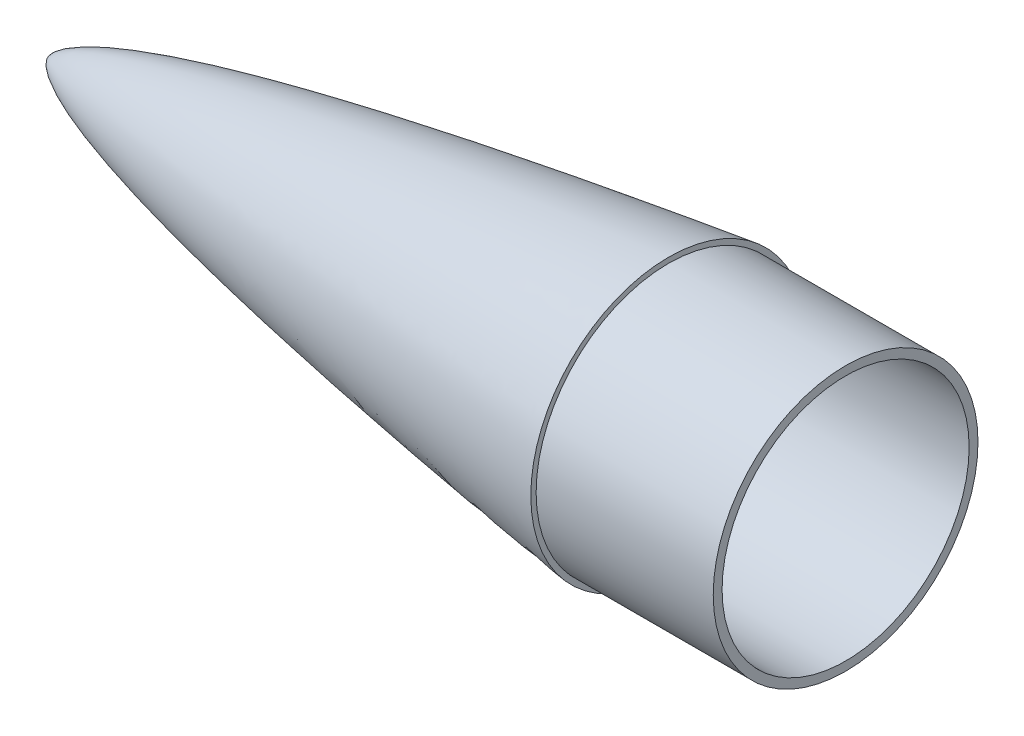
ISO-10303-21;
HEADER;
FILE_DESCRIPTION(('STEP AP214'),'2;1');
FILE_NAME('part.step','',(''),(''),'','','');
FILE_SCHEMA(('AUTOMOTIVE_DESIGN { 1 0 10303 214 1 1 1 1 }'));
ENDSEC;
DATA;
#1=APPLICATION_CONTEXT('core data for automotive mechanical design processes');
#2=APPLICATION_PROTOCOL_DEFINITION('international standard','automotive_design',2000,#1);
#3=PRODUCT_CONTEXT('',#1,'mechanical');
#4=PRODUCT('Part','Part','',(#3));
#5=PRODUCT_RELATED_PRODUCT_CATEGORY('part','',(#4));
#6=PRODUCT_DEFINITION_FORMATION('','',#4);
#7=PRODUCT_DEFINITION_CONTEXT('part definition',#1,'design');
#8=PRODUCT_DEFINITION('design','',#6,#7);
#9=PRODUCT_DEFINITION_SHAPE('','',#8);
#10=(LENGTH_UNIT() NAMED_UNIT(*) SI_UNIT(.MILLI.,.METRE.));
#11=(NAMED_UNIT(*) PLANE_ANGLE_UNIT() SI_UNIT($,.RADIAN.));
#12=(NAMED_UNIT(*) SI_UNIT($,.STERADIAN.) SOLID_ANGLE_UNIT());
#13=UNCERTAINTY_MEASURE_WITH_UNIT(LENGTH_MEASURE(1.E-05),#10,'distance_accuracy_value','');
#14=(GEOMETRIC_REPRESENTATION_CONTEXT(3) GLOBAL_UNCERTAINTY_ASSIGNED_CONTEXT((#13)) GLOBAL_UNIT_ASSIGNED_CONTEXT((#10,
#11,#12)) REPRESENTATION_CONTEXT('',''));
#15=CARTESIAN_POINT('',(0.,0.,0.));
#16=DIRECTION('',(0.,0.,1.));
#17=DIRECTION('',(1.,0.,0.));
#18=AXIS2_PLACEMENT_3D('',#15,#16,#17);
#19=CARTESIAN_POINT('',(177.800000000009,39.4970000000012,0.));
#20=CARTESIAN_POINT('',(176.178727643466,39.2809075559077,0.));
#21=CARTESIAN_POINT('',(172.968799311404,38.8505379951279,0.));
#22=CARTESIAN_POINT('',(164.775389208671,37.7430030762193,0.));
#23=CARTESIAN_POINT('',(156.832110093129,36.6373786481141,0.));
#24=CARTESIAN_POINT('',(147.350935205643,35.2966815301408,0.));
#25=CARTESIAN_POINT('',(138.793746088433,34.0458877619815,0.));
#26=CARTESIAN_POINT('',(131.522546009152,32.9671917953403,0.));
#27=CARTESIAN_POINT('',(122.752365032361,31.6325936773946,0.));
#28=CARTESIAN_POINT('',(113.812915334792,30.2341823119538,0.));
#29=CARTESIAN_POINT('',(104.992962687121,28.8051871055108,0.));
#30=CARTESIAN_POINT('',(94.3499024667432,27.0186579277091,0.));
#31=CARTESIAN_POINT('',(83.7510698808431,25.1673253179259,0.));
#32=CARTESIAN_POINT('',(71.384419608706,22.8880291437135,0.));
#33=CARTESIAN_POINT('',(57.3041835123397,20.0811385682309,0.));
#34=CARTESIAN_POINT('',(43.2716349653263,17.0029970097876,0.));
#35=CARTESIAN_POINT('',(30.5222721655851,13.8323204159297,0.));
#36=CARTESIAN_POINT('',(19.9297851094246,10.7503227969859,0.));
#37=CARTESIAN_POINT('',(12.0890081878575,7.9709109246155,0.));
#38=CARTESIAN_POINT('',(7.25984645414596,5.86852722696386,0.));
#39=CARTESIAN_POINT('',(4.3979471854356,4.33981301159928,0.));
#40=CARTESIAN_POINT('',(2.72297424966447,3.25205177367329,0.));
#41=CARTESIAN_POINT('',(1.71709349123853,2.46475207749337,0.));
#42=CARTESIAN_POINT('',(1.09217895464707,1.87847304036459,0.));
#43=CARTESIAN_POINT('',(0.693065726513427,1.43044512424637,0.));
#44=CARTESIAN_POINT('',(0.431084132938626,1.07751191409142,0.));
#45=CARTESIAN_POINT('',(0.260450214874567,0.797955692989517,0.));
#46=CARTESIAN_POINT('',(0.152836991138061,0.580341169212031,0.));
#47=CARTESIAN_POINT('',(0.0810053175082553,0.398813510299678,0.));
#48=CARTESIAN_POINT('',(0.0329268852463626,0.240593092479586,0.));
#49=CARTESIAN_POINT('',(0.00910613088181757,0.125457884524254,0.));
#50=CARTESIAN_POINT('',(0.00147371563253512,0.042002043598334,0.));
#51=CARTESIAN_POINT('',(0.,0.,0.));
#52=B_SPLINE_CURVE_WITH_KNOTS('',4,(#19,#20,#21,#22,#23,#24,#25,#26,#27,#28,#29,#30,#31,#32,#33,
#34,#35,#36,#37,#38,#39,#40,#41,#42,#43,#44,#45,#46,#47,#48,#49,#50,#51),.UNSPECIFIED.,.F.,.F.,
(5,1,1,1,1,1,1,1,1,1,1,1,1,1,1,1,1,1,1,1,1,1,1,1,1,1,1,1,1,5),(0.,0.0356042878016428,
0.0712085756032855,0.142417151188438,0.178021439154519,0.2136257271206,0.249230015555637,
0.284834303990673,0.356042878544841,0.391647167276316,0.427251456007792,0.498460029638262,
0.569668603908514,0.640877178579804,0.712085750010427,0.783294307326094,0.830224354341039,
0.859550160692094,0.876978816126831,0.88764975815093,0.894508007867041,0.89911015583758,
0.902281625885053,0.904621315573676,0.906393261460102,0.907815880454247,0.908768487133918,
0.90942992023538,0.910261303233446,0.911092686231512),.UNSPECIFIED.);
#53=CARTESIAN_POINT('',(0.,0.,0.));
#54=DIRECTION('',(-1.,0.,0.));
#55=AXIS1_PLACEMENT('',#53,#54);
#56=SURFACE_OF_REVOLUTION('',#52,#55);
#57=CARTESIAN_POINT('',(0.,0.,0.));
#58=VERTEX_POINT('',#57);
#59=VERTEX_LOOP('',#58);
#60=FACE_BOUND('',#59,.T.);
#61=CARTESIAN_POINT('',(177.800000000006,0.,0.));
#62=DIRECTION('',(-1.,0.,0.));
#63=DIRECTION('',(0.,0.,1.));
#64=AXIS2_PLACEMENT_3D('',#61,#62,#63);
#65=CIRCLE('',#64,39.4970000000008);
#66=CARTESIAN_POINT('',(177.800000000006,0.,39.4970000000008));
#67=VERTEX_POINT('',#66);
#68=EDGE_CURVE('E56',#67,#67,#65,.T.);
#69=ORIENTED_EDGE('',*,*,#68,.T.);
#70=EDGE_LOOP('',(#69));
#71=FACE_BOUND('',#70,.T.);
#72=ADVANCED_FACE('F47',(#60,#71),#56,.T.);
#73=CARTESIAN_POINT('',(177.800000000006,0.,0.));
#74=DIRECTION('',(-1.,0.,0.));
#75=DIRECTION('',(0.,0.,1.));
#76=AXIS2_PLACEMENT_3D('',#73,#74,#75);
#77=PLANE('',#76);
#78=CARTESIAN_POINT('',(177.800000000006,0.,0.));
#79=DIRECTION('',(-1.,0.,0.));
#80=DIRECTION('',(0.,0.,1.));
#81=AXIS2_PLACEMENT_3D('',#78,#79,#80);
#82=CIRCLE('',#81,37.973);
#83=CARTESIAN_POINT('',(177.800000000006,0.,37.973));
#84=VERTEX_POINT('',#83);
#85=EDGE_CURVE('E11',#84,#84,#82,.F.);
#86=ORIENTED_EDGE('',*,*,#85,.F.);
#87=EDGE_LOOP('',(#86));
#88=FACE_BOUND('',#87,.T.);
#89=ORIENTED_EDGE('',*,*,#68,.F.);
#90=EDGE_LOOP('',(#89));
#91=FACE_BOUND('',#90,.T.);
#92=ADVANCED_FACE('F106',(#88,#91),#77,.F.);
#93=CARTESIAN_POINT('',(228.600000000006,0.,0.));
#94=DIRECTION('',(-1.,0.,0.));
#95=DIRECTION('',(0.,0.,1.));
#96=AXIS2_PLACEMENT_3D('',#93,#94,#95);
#97=CYLINDRICAL_SURFACE('',#96,37.973);
#98=CARTESIAN_POINT('',(228.600000000006,0.,0.));
#99=DIRECTION('',(1.,0.,0.));
#100=DIRECTION('',(0.,0.,-1.));
#101=AXIS2_PLACEMENT_3D('',#98,#99,#100);
#102=CIRCLE('',#101,37.973);
#103=CARTESIAN_POINT('',(228.600000000006,0.,-37.973));
#104=VERTEX_POINT('',#103);
#105=EDGE_CURVE('E79',#104,#104,#102,.T.);
#106=ORIENTED_EDGE('',*,*,#105,.F.);
#107=EDGE_LOOP('',(#106));
#108=FACE_BOUND('',#107,.T.);
#109=ORIENTED_EDGE('',*,*,#85,.T.);
#110=EDGE_LOOP('',(#109));
#111=FACE_BOUND('',#110,.T.);
#112=ADVANCED_FACE('F103',(#108,#111),#97,.T.);
#113=CARTESIAN_POINT('',(228.600000000006,0.,0.));
#114=DIRECTION('',(1.,0.,0.));
#115=DIRECTION('',(0.,0.,-1.));
#116=AXIS2_PLACEMENT_3D('',#113,#114,#115);
#117=PLANE('',#116);
#118=CARTESIAN_POINT('',(228.600000000006,0.,0.));
#119=DIRECTION('',(1.,0.,0.));
#120=DIRECTION('',(0.,0.,-1.));
#121=AXIS2_PLACEMENT_3D('',#118,#119,#120);
#122=CIRCLE('',#121,35.433);
#123=CARTESIAN_POINT('',(228.600000000006,0.,-35.433));
#124=VERTEX_POINT('',#123);
#125=EDGE_CURVE('E74',#124,#124,#122,.T.);
#126=ORIENTED_EDGE('',*,*,#125,.F.);
#127=EDGE_LOOP('',(#126));
#128=FACE_BOUND('',#127,.T.);
#129=ORIENTED_EDGE('',*,*,#105,.T.);
#130=EDGE_LOOP('',(#129));
#131=FACE_BOUND('',#130,.T.);
#132=ADVANCED_FACE('F66',(#128,#131),#117,.T.);
#133=CARTESIAN_POINT('',(177.800000000009,39.4970000000012,0.));
#134=CARTESIAN_POINT('',(176.178727643466,39.2809075559077,0.));
#135=CARTESIAN_POINT('',(172.968799311404,38.8505379951279,0.));
#136=CARTESIAN_POINT('',(164.775389208671,37.7430030762193,0.));
#137=CARTESIAN_POINT('',(156.832110093129,36.6373786481141,0.));
#138=CARTESIAN_POINT('',(147.350935205643,35.2966815301408,0.));
#139=CARTESIAN_POINT('',(138.793746088433,34.0458877619815,0.));
#140=CARTESIAN_POINT('',(131.522546009152,32.9671917953403,0.));
#141=CARTESIAN_POINT('',(122.752365032361,31.6325936773946,0.));
#142=CARTESIAN_POINT('',(113.812915334792,30.2341823119538,0.));
#143=CARTESIAN_POINT('',(104.992962687121,28.8051871055108,0.));
#144=CARTESIAN_POINT('',(94.3499024667432,27.0186579277091,0.));
#145=CARTESIAN_POINT('',(83.7510698808431,25.1673253179259,0.));
#146=CARTESIAN_POINT('',(71.384419608706,22.8880291437135,0.));
#147=CARTESIAN_POINT('',(57.3041835123397,20.0811385682309,0.));
#148=CARTESIAN_POINT('',(43.2716349653263,17.0029970097876,0.));
#149=CARTESIAN_POINT('',(30.5222721655851,13.8323204159297,0.));
#150=CARTESIAN_POINT('',(19.9297851094246,10.7503227969859,0.));
#151=CARTESIAN_POINT('',(12.0890081878575,7.9709109246155,0.));
#152=CARTESIAN_POINT('',(7.25984645414596,5.86852722696386,0.));
#153=CARTESIAN_POINT('',(4.3979471854356,4.33981301159928,0.));
#154=CARTESIAN_POINT('',(2.72297424966447,3.25205177367329,0.));
#155=CARTESIAN_POINT('',(1.76539010535685,2.50255368499343,0.));
#156=CARTESIAN_POINT('',(1.26809316573394,2.04288782793937,0.));
#157=CARTESIAN_POINT('',(1.03797317848869,1.80530072902517,0.));
#158=CARTESIAN_POINT('',(0.97065663624148,1.73318325151714,0.));
#159=B_SPLINE_CURVE_WITH_KNOTS('',4,(#133,#134,#135,#136,#137,#138,#139,#140,#141,#142,#143,
#144,#145,#146,#147,#148,#149,#150,#151,#152,#153,#154,#155,#156,#157,#158),.UNSPECIFIED.,.F.,
.F.,(5,1,1,1,1,1,1,1,1,1,1,1,1,1,1,1,1,1,1,1,1,1,5),(0.,0.0356042878016428,0.0712085756032855,
0.142417151188438,0.178021439154519,0.2136257271206,0.249230015555637,0.284834303990673,
0.356042878544841,0.391647167276316,0.427251456007792,0.498460029638262,0.569668603908514,
0.640877178579804,0.712085750010427,0.783294307326094,0.830224354341039,0.859550160692094,
0.876978816126831,0.88764975815093,0.894508007867041,0.89911015583758,0.901066730353186),.UNSPECIFIED.);
#160=CARTESIAN_POINT('',(0.,0.,0.));
#161=DIRECTION('',(-1.,0.,0.));
#162=AXIS1_PLACEMENT('',#160,#161);
#163=SURFACE_OF_REVOLUTION('',#159,#162);
#164=OFFSET_SURFACE('',#163,-2.54,.F.);
#165=CARTESIAN_POINT('',(2.82744844381188,0.,0.));
#166=VERTEX_POINT('',#165);
#167=VERTEX_LOOP('',#166);
#168=FACE_BOUND('',#167,.T.);
#169=CARTESIAN_POINT('',(175.260000000006,0.,0.));
#170=DIRECTION('',(-1.,0.,0.));
#171=DIRECTION('',(0.,0.,1.));
#172=AXIS2_PLACEMENT_3D('',#169,#170,#171);
#173=CIRCLE('',#172,36.5945326964676);
#174=CARTESIAN_POINT('',(175.260000000006,0.,36.5945326964676));
#175=VERTEX_POINT('',#174);
#176=EDGE_CURVE('E70',#175,#175,#173,.T.);
#177=ORIENTED_EDGE('',*,*,#176,.F.);
#178=EDGE_LOOP('',(#177));
#179=FACE_BOUND('',#178,.T.);
#180=ADVANCED_FACE('F62',(#168,#179),#164,.F.);
#181=CARTESIAN_POINT('',(175.260000000006,0.,0.));
#182=DIRECTION('',(-1.,0.,0.));
#183=DIRECTION('',(0.,0.,1.));
#184=AXIS2_PLACEMENT_3D('',#181,#182,#183);
#185=PLANE('',#184);
#186=CARTESIAN_POINT('',(175.260000000006,0.,0.));
#187=DIRECTION('',(-1.,0.,0.));
#188=DIRECTION('',(0.,0.,1.));
#189=AXIS2_PLACEMENT_3D('',#186,#187,#188);
#190=CIRCLE('',#189,35.433);
#191=CARTESIAN_POINT('',(175.260000000006,0.,35.433));
#192=VERTEX_POINT('',#191);
#193=EDGE_CURVE('E73',#192,#192,#190,.F.);
#194=ORIENTED_EDGE('',*,*,#193,.T.);
#195=EDGE_LOOP('',(#194));
#196=FACE_BOUND('',#195,.T.);
#197=ORIENTED_EDGE('',*,*,#176,.T.);
#198=EDGE_LOOP('',(#197));
#199=FACE_BOUND('',#198,.T.);
#200=ADVANCED_FACE('F65',(#196,#199),#185,.T.);
#201=CARTESIAN_POINT('',(228.600000000006,0.,0.));
#202=DIRECTION('',(-1.,0.,0.));
#203=DIRECTION('',(0.,0.,1.));
#204=AXIS2_PLACEMENT_3D('',#201,#202,#203);
#205=CYLINDRICAL_SURFACE('',#204,35.433);
#206=ORIENTED_EDGE('',*,*,#125,.T.);
#207=EDGE_LOOP('',(#206));
#208=FACE_BOUND('',#207,.T.);
#209=ORIENTED_EDGE('',*,*,#193,.F.);
#210=EDGE_LOOP('',(#209));
#211=FACE_BOUND('',#210,.T.);
#212=ADVANCED_FACE('F96',(#208,#211),#205,.F.);
#213=CLOSED_SHELL('',(#72,#92,#112,#132,#180,#200,#212));
#214=MANIFOLD_SOLID_BREP('B2',#213);
#215=ADVANCED_BREP_SHAPE_REPRESENTATION('',(#18,#214),#14);
#216=SHAPE_DEFINITION_REPRESENTATION(#9,#215);
ENDSEC;
END-ISO-10303-21;
